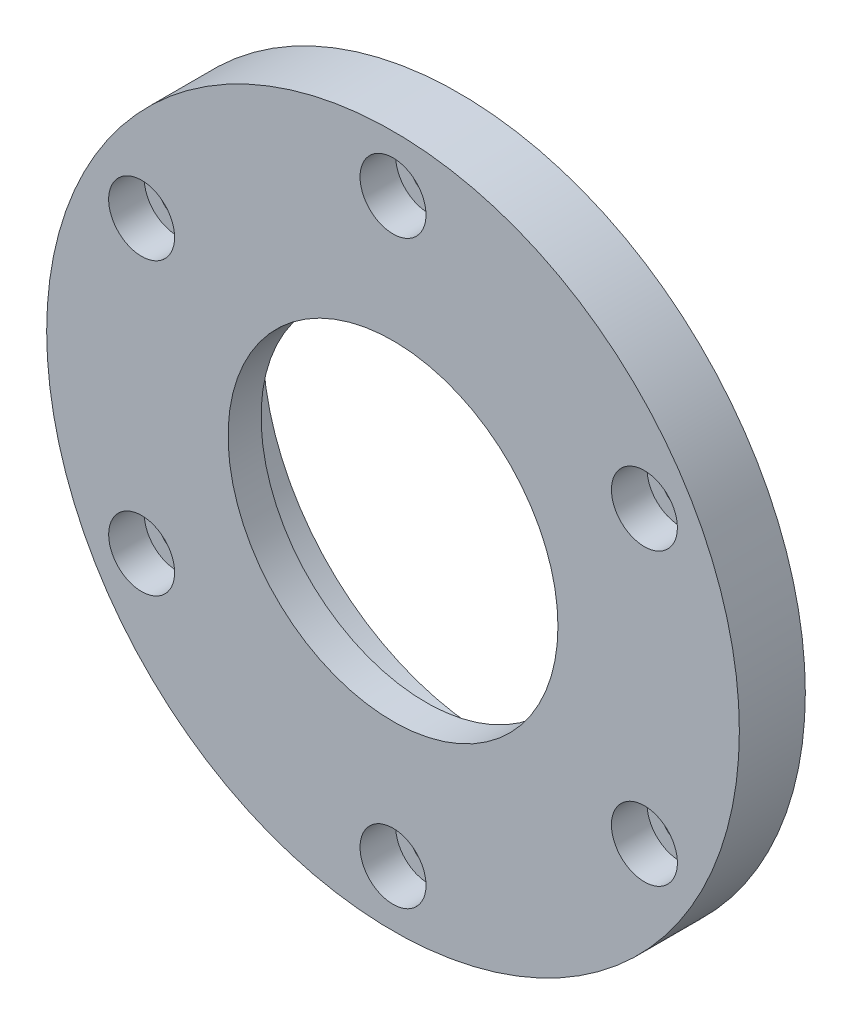
ISO-10303-21;
HEADER;
FILE_DESCRIPTION(('STEP AP214'),'2;1');
FILE_NAME('part.step','',(''),(''),'','','');
FILE_SCHEMA(('AUTOMOTIVE_DESIGN { 1 0 10303 214 1 1 1 1 }'));
ENDSEC;
DATA;
#1=APPLICATION_CONTEXT('core data for automotive mechanical design processes');
#2=APPLICATION_PROTOCOL_DEFINITION('international standard','automotive_design',2000,#1);
#3=PRODUCT_CONTEXT('',#1,'mechanical');
#4=PRODUCT('Part','Part','',(#3));
#5=PRODUCT_RELATED_PRODUCT_CATEGORY('part','',(#4));
#6=PRODUCT_DEFINITION_FORMATION('','',#4);
#7=PRODUCT_DEFINITION_CONTEXT('part definition',#1,'design');
#8=PRODUCT_DEFINITION('design','',#6,#7);
#9=PRODUCT_DEFINITION_SHAPE('','',#8);
#10=(LENGTH_UNIT() NAMED_UNIT(*) SI_UNIT(.MILLI.,.METRE.));
#11=(NAMED_UNIT(*) PLANE_ANGLE_UNIT() SI_UNIT($,.RADIAN.));
#12=(NAMED_UNIT(*) SI_UNIT($,.STERADIAN.) SOLID_ANGLE_UNIT());
#13=UNCERTAINTY_MEASURE_WITH_UNIT(LENGTH_MEASURE(1.E-05),#10,'distance_accuracy_value','');
#14=(GEOMETRIC_REPRESENTATION_CONTEXT(3) GLOBAL_UNCERTAINTY_ASSIGNED_CONTEXT((#13)) GLOBAL_UNIT_ASSIGNED_CONTEXT((#10,
#11,#12)) REPRESENTATION_CONTEXT('',''));
#15=CARTESIAN_POINT('',(0.,0.,0.));
#16=DIRECTION('',(0.,0.,1.));
#17=DIRECTION('',(1.,0.,0.));
#18=AXIS2_PLACEMENT_3D('',#15,#16,#17);
#19=CARTESIAN_POINT('',(0.,0.,10.));
#20=DIRECTION('',(0.,0.,1.));
#21=DIRECTION('',(1.,0.,0.));
#22=AXIS2_PLACEMENT_3D('',#19,#20,#21);
#23=PLANE('',#22);
#24=CARTESIAN_POINT('',(-38.105117766515,-22.0000000000004,10.));
#25=DIRECTION('',(0.,0.,1.));
#26=DIRECTION('',(0.50000000000001,-0.866025403784433,0.));
#27=AXIS2_PLACEMENT_3D('',#24,#25,#26);
#28=CIRCLE('',#27,5.);
#29=CARTESIAN_POINT('',(-35.605117766515,-26.3301270189226,10.));
#30=VERTEX_POINT('',#29);
#31=EDGE_CURVE('E158',#30,#30,#28,.T.);
#32=ORIENTED_EDGE('',*,*,#31,.F.);
#33=EDGE_LOOP('',(#32));
#34=FACE_BOUND('',#33,.T.);
#35=CARTESIAN_POINT('',(-38.1051177665155,21.9999999999996,10.));
#36=DIRECTION('',(0.,0.,1.));
#37=DIRECTION('',(-0.499999999999992,-0.866025403784443,0.));
#38=AXIS2_PLACEMENT_3D('',#35,#36,#37);
#39=CIRCLE('',#38,5.);
#40=CARTESIAN_POINT('',(-40.6051177665155,17.6698729810774,10.));
#41=VERTEX_POINT('',#40);
#42=EDGE_CURVE('E145',#41,#41,#39,.T.);
#43=ORIENTED_EDGE('',*,*,#42,.F.);
#44=EDGE_LOOP('',(#43));
#45=FACE_BOUND('',#44,.T.);
#46=CARTESIAN_POINT('',(0.,44.,10.));
#47=DIRECTION('',(0.,0.,1.));
#48=DIRECTION('',(-1.,0.,0.));
#49=AXIS2_PLACEMENT_3D('',#46,#47,#48);
#50=CIRCLE('',#49,5.);
#51=CARTESIAN_POINT('',(-5.,44.,10.));
#52=VERTEX_POINT('',#51);
#53=EDGE_CURVE('E133',#52,#52,#50,.T.);
#54=ORIENTED_EDGE('',*,*,#53,.F.);
#55=EDGE_LOOP('',(#54));
#56=FACE_BOUND('',#55,.T.);
#57=CARTESIAN_POINT('',(38.1051177665152,22.0000000000002,10.));
#58=DIRECTION('',(0.,0.,1.));
#59=DIRECTION('',(-0.500000000000004,0.866025403784436,0.));
#60=AXIS2_PLACEMENT_3D('',#57,#58,#59);
#61=CIRCLE('',#60,5.);
#62=CARTESIAN_POINT('',(35.6051177665152,26.3301270189224,10.));
#63=VERTEX_POINT('',#62);
#64=EDGE_CURVE('E121',#63,#63,#61,.T.);
#65=ORIENTED_EDGE('',*,*,#64,.F.);
#66=EDGE_LOOP('',(#65));
#67=FACE_BOUND('',#66,.T.);
#68=CARTESIAN_POINT('',(38.1051177665153,-21.9999999999999,10.));
#69=DIRECTION('',(0.,0.,1.));
#70=DIRECTION('',(0.499999999999998,0.86602540378444,0.));
#71=AXIS2_PLACEMENT_3D('',#68,#69,#70);
#72=CIRCLE('',#71,5.);
#73=CARTESIAN_POINT('',(40.6051177665153,-17.6698729810777,10.));
#74=VERTEX_POINT('',#73);
#75=EDGE_CURVE('E109',#74,#74,#72,.T.);
#76=ORIENTED_EDGE('',*,*,#75,.F.);
#77=EDGE_LOOP('',(#76));
#78=FACE_BOUND('',#77,.T.);
#79=CARTESIAN_POINT('',(0.,-44.,10.));
#80=DIRECTION('',(0.,0.,1.));
#81=DIRECTION('',(1.,0.,0.));
#82=AXIS2_PLACEMENT_3D('',#79,#80,#81);
#83=CIRCLE('',#82,5.);
#84=CARTESIAN_POINT('',(5.,-44.,10.));
#85=VERTEX_POINT('',#84);
#86=EDGE_CURVE('E97',#85,#85,#83,.T.);
#87=ORIENTED_EDGE('',*,*,#86,.F.);
#88=EDGE_LOOP('',(#87));
#89=FACE_BOUND('',#88,.T.);
#90=CARTESIAN_POINT('',(0.,0.,10.));
#91=DIRECTION('',(0.,0.,1.));
#92=DIRECTION('',(1.,0.,0.));
#93=AXIS2_PLACEMENT_3D('',#90,#91,#92);
#94=CIRCLE('',#93,52.5);
#95=CARTESIAN_POINT('',(52.5,0.,10.));
#96=VERTEX_POINT('',#95);
#97=EDGE_CURVE('E64',#96,#96,#94,.T.);
#98=ORIENTED_EDGE('',*,*,#97,.T.);
#99=EDGE_LOOP('',(#98));
#100=FACE_BOUND('',#99,.T.);
#101=CARTESIAN_POINT('',(0.,0.,10.));
#102=DIRECTION('',(0.,0.,1.));
#103=DIRECTION('',(1.,0.,0.));
#104=AXIS2_PLACEMENT_3D('',#101,#102,#103);
#105=CIRCLE('',#104,25.);
#106=CARTESIAN_POINT('',(25.,0.,10.));
#107=VERTEX_POINT('',#106);
#108=EDGE_CURVE('E68',#107,#107,#105,.T.);
#109=ORIENTED_EDGE('',*,*,#108,.F.);
#110=EDGE_LOOP('',(#109));
#111=FACE_BOUND('',#110,.T.);
#112=ADVANCED_FACE('F39',(#34,#45,#56,#67,#78,#89,#100,#111),#23,.T.);
#113=CARTESIAN_POINT('',(0.,0.,5.));
#114=DIRECTION('',(0.,0.,1.));
#115=DIRECTION('',(1.,0.,0.));
#116=AXIS2_PLACEMENT_3D('',#113,#114,#115);
#117=PLANE('',#116);
#118=CARTESIAN_POINT('',(0.,0.,5.));
#119=DIRECTION('',(0.,0.,1.));
#120=DIRECTION('',(1.,0.,0.));
#121=AXIS2_PLACEMENT_3D('',#118,#119,#120);
#122=CIRCLE('',#121,34.75);
#123=CARTESIAN_POINT('',(34.75,0.,5.));
#124=VERTEX_POINT('',#123);
#125=EDGE_CURVE('E83',#124,#124,#122,.T.);
#126=ORIENTED_EDGE('',*,*,#125,.F.);
#127=EDGE_LOOP('',(#126));
#128=FACE_BOUND('',#127,.T.);
#129=CARTESIAN_POINT('',(0.,0.,5.));
#130=DIRECTION('',(0.,0.,1.));
#131=DIRECTION('',(1.,0.,0.));
#132=AXIS2_PLACEMENT_3D('',#129,#130,#131);
#133=CIRCLE('',#132,25.);
#134=CARTESIAN_POINT('',(25.,0.,5.));
#135=VERTEX_POINT('',#134);
#136=EDGE_CURVE('E70',#135,#135,#133,.F.);
#137=ORIENTED_EDGE('',*,*,#136,.F.);
#138=EDGE_LOOP('',(#137));
#139=FACE_BOUND('',#138,.T.);
#140=ADVANCED_FACE('F196',(#128,#139),#117,.F.);
#141=CARTESIAN_POINT('',(0.,0.,-5.));
#142=DIRECTION('',(0.,0.,1.));
#143=DIRECTION('',(1.,0.,0.));
#144=AXIS2_PLACEMENT_3D('',#141,#142,#143);
#145=PLANE('',#144);
#146=CARTESIAN_POINT('',(0.,0.,-5.));
#147=DIRECTION('',(0.,0.,1.));
#148=DIRECTION('',(1.,0.,0.));
#149=AXIS2_PLACEMENT_3D('',#146,#147,#148);
#150=CIRCLE('',#149,38.);
#151=CARTESIAN_POINT('',(38.,0.,-5.));
#152=VERTEX_POINT('',#151);
#153=EDGE_CURVE('E77',#152,#152,#150,.T.);
#154=ORIENTED_EDGE('',*,*,#153,.F.);
#155=EDGE_LOOP('',(#154));
#156=FACE_BOUND('',#155,.T.);
#157=CARTESIAN_POINT('',(0.,0.,-5.));
#158=DIRECTION('',(0.,0.,1.));
#159=DIRECTION('',(1.,0.,0.));
#160=AXIS2_PLACEMENT_3D('',#157,#158,#159);
#161=CIRCLE('',#160,34.75);
#162=CARTESIAN_POINT('',(34.75,0.,-5.));
#163=VERTEX_POINT('',#162);
#164=EDGE_CURVE('E73',#163,#163,#161,.T.);
#165=ORIENTED_EDGE('',*,*,#164,.T.);
#166=EDGE_LOOP('',(#165));
#167=FACE_BOUND('',#166,.T.);
#168=ADVANCED_FACE('F188',(#156,#167),#145,.F.);
#169=CARTESIAN_POINT('',(0.,0.,10.));
#170=DIRECTION('',(0.,0.,-1.));
#171=DIRECTION('',(-1.,0.,0.));
#172=AXIS2_PLACEMENT_3D('',#169,#170,#171);
#173=CYLINDRICAL_SURFACE('',#172,52.5);
#174=ORIENTED_EDGE('',*,*,#97,.F.);
#175=EDGE_LOOP('',(#174));
#176=FACE_BOUND('',#175,.T.);
#177=CARTESIAN_POINT('',(0.,0.,0.));
#178=DIRECTION('',(0.,0.,1.));
#179=DIRECTION('',(1.,0.,0.));
#180=AXIS2_PLACEMENT_3D('',#177,#178,#179);
#181=CIRCLE('',#180,52.5);
#182=CARTESIAN_POINT('',(52.5,0.,0.));
#183=VERTEX_POINT('',#182);
#184=EDGE_CURVE('E74',#183,#183,#181,.T.);
#185=ORIENTED_EDGE('',*,*,#184,.T.);
#186=EDGE_LOOP('',(#185));
#187=FACE_BOUND('',#186,.T.);
#188=ADVANCED_FACE('F171',(#176,#187),#173,.T.);
#189=CARTESIAN_POINT('',(0.,0.,0.));
#190=DIRECTION('',(0.,0.,1.));
#191=DIRECTION('',(1.,0.,0.));
#192=AXIS2_PLACEMENT_3D('',#189,#190,#191);
#193=PLANE('',#192);
#194=CARTESIAN_POINT('',(0.,0.,0.));
#195=DIRECTION('',(0.,0.,-1.));
#196=DIRECTION('',(-1.,0.,0.));
#197=AXIS2_PLACEMENT_3D('',#194,#195,#196);
#198=CIRCLE('',#197,40.85);
#199=CARTESIAN_POINT('',(-40.85,0.,0.));
#200=VERTEX_POINT('',#199);
#201=EDGE_CURVE('E161',#200,#200,#198,.T.);
#202=ORIENTED_EDGE('',*,*,#201,.F.);
#203=EDGE_LOOP('',(#202));
#204=FACE_BOUND('',#203,.T.);
#205=CARTESIAN_POINT('',(-38.105117766515,-22.0000000000004,0.));
#206=DIRECTION('',(0.,0.,1.));
#207=DIRECTION('',(0.50000000000001,-0.866025403784433,0.));
#208=AXIS2_PLACEMENT_3D('',#205,#206,#207);
#209=CIRCLE('',#208,2.75);
#210=CARTESIAN_POINT('',(-36.730117766515,-24.3815698604076,0.));
#211=VERTEX_POINT('',#210);
#212=EDGE_CURVE('E155',#211,#211,#209,.T.);
#213=ORIENTED_EDGE('',*,*,#212,.T.);
#214=EDGE_LOOP('',(#213));
#215=FACE_BOUND('',#214,.T.);
#216=CARTESIAN_POINT('',(-38.1051177665155,21.9999999999996,0.));
#217=DIRECTION('',(0.,0.,1.));
#218=DIRECTION('',(-0.499999999999992,-0.866025403784443,0.));
#219=AXIS2_PLACEMENT_3D('',#216,#217,#218);
#220=CIRCLE('',#219,2.75);
#221=CARTESIAN_POINT('',(-39.4801177665155,19.6184301395924,0.));
#222=VERTEX_POINT('',#221);
#223=EDGE_CURVE('E142',#222,#222,#220,.T.);
#224=ORIENTED_EDGE('',*,*,#223,.T.);
#225=EDGE_LOOP('',(#224));
#226=FACE_BOUND('',#225,.T.);
#227=CARTESIAN_POINT('',(0.,44.,0.));
#228=DIRECTION('',(0.,0.,1.));
#229=DIRECTION('',(-1.,0.,0.));
#230=AXIS2_PLACEMENT_3D('',#227,#228,#229);
#231=CIRCLE('',#230,2.75);
#232=CARTESIAN_POINT('',(-2.75,44.,0.));
#233=VERTEX_POINT('',#232);
#234=EDGE_CURVE('E130',#233,#233,#231,.T.);
#235=ORIENTED_EDGE('',*,*,#234,.T.);
#236=EDGE_LOOP('',(#235));
#237=FACE_BOUND('',#236,.T.);
#238=CARTESIAN_POINT('',(38.1051177665152,22.0000000000002,0.));
#239=DIRECTION('',(0.,0.,1.));
#240=DIRECTION('',(-0.500000000000004,0.866025403784436,0.));
#241=AXIS2_PLACEMENT_3D('',#238,#239,#240);
#242=CIRCLE('',#241,2.75);
#243=CARTESIAN_POINT('',(36.7301177665152,24.3815698604074,0.));
#244=VERTEX_POINT('',#243);
#245=EDGE_CURVE('E118',#244,#244,#242,.T.);
#246=ORIENTED_EDGE('',*,*,#245,.T.);
#247=EDGE_LOOP('',(#246));
#248=FACE_BOUND('',#247,.T.);
#249=CARTESIAN_POINT('',(38.1051177665153,-21.9999999999999,0.));
#250=DIRECTION('',(0.,0.,1.));
#251=DIRECTION('',(0.499999999999998,0.86602540378444,0.));
#252=AXIS2_PLACEMENT_3D('',#249,#250,#251);
#253=CIRCLE('',#252,2.75);
#254=CARTESIAN_POINT('',(39.4801177665153,-19.6184301395927,0.));
#255=VERTEX_POINT('',#254);
#256=EDGE_CURVE('E106',#255,#255,#253,.T.);
#257=ORIENTED_EDGE('',*,*,#256,.T.);
#258=EDGE_LOOP('',(#257));
#259=FACE_BOUND('',#258,.T.);
#260=CARTESIAN_POINT('',(0.,-44.,0.));
#261=DIRECTION('',(0.,0.,1.));
#262=DIRECTION('',(1.,0.,0.));
#263=AXIS2_PLACEMENT_3D('',#260,#261,#262);
#264=CIRCLE('',#263,2.75);
#265=CARTESIAN_POINT('',(2.75,-44.,0.));
#266=VERTEX_POINT('',#265);
#267=EDGE_CURVE('E65',#266,#266,#264,.T.);
#268=ORIENTED_EDGE('',*,*,#267,.T.);
#269=EDGE_LOOP('',(#268));
#270=FACE_BOUND('',#269,.T.);
#271=ORIENTED_EDGE('',*,*,#184,.F.);
#272=EDGE_LOOP('',(#271));
#273=FACE_BOUND('',#272,.T.);
#274=ADVANCED_FACE('F167',(#204,#215,#226,#237,#248,#259,#270,#273),#193,.F.);
#275=CARTESIAN_POINT('',(0.,0.,-5.));
#276=DIRECTION('',(0.,0.,1.));
#277=DIRECTION('',(1.,0.,0.));
#278=AXIS2_PLACEMENT_3D('',#275,#276,#277);
#279=CYLINDRICAL_SURFACE('',#278,38.);
#280=CARTESIAN_POINT('',(0.,0.,1.15));
#281=DIRECTION('',(0.,0.,-1.));
#282=DIRECTION('',(-1.,0.,0.));
#283=AXIS2_PLACEMENT_3D('',#280,#281,#282);
#284=CIRCLE('',#283,38.);
#285=CARTESIAN_POINT('',(-38.,0.,1.15));
#286=VERTEX_POINT('',#285);
#287=EDGE_CURVE('E59',#286,#286,#284,.T.);
#288=ORIENTED_EDGE('',*,*,#287,.T.);
#289=EDGE_LOOP('',(#288));
#290=FACE_BOUND('',#289,.T.);
#291=ORIENTED_EDGE('',*,*,#153,.T.);
#292=EDGE_LOOP('',(#291));
#293=FACE_BOUND('',#292,.T.);
#294=ADVANCED_FACE('F170',(#290,#293),#279,.T.);
#295=CARTESIAN_POINT('',(0.,0.,5.));
#296=DIRECTION('',(0.,0.,-1.));
#297=DIRECTION('',(-1.,0.,0.));
#298=AXIS2_PLACEMENT_3D('',#295,#296,#297);
#299=CYLINDRICAL_SURFACE('',#298,34.75);
#300=ORIENTED_EDGE('',*,*,#125,.T.);
#301=EDGE_LOOP('',(#300));
#302=FACE_BOUND('',#301,.T.);
#303=ORIENTED_EDGE('',*,*,#164,.F.);
#304=EDGE_LOOP('',(#303));
#305=FACE_BOUND('',#304,.T.);
#306=ADVANCED_FACE('F213',(#302,#305),#299,.F.);
#307=CARTESIAN_POINT('',(0.,0.,10.));
#308=DIRECTION('',(0.,0.,-1.));
#309=DIRECTION('',(-1.,0.,0.));
#310=AXIS2_PLACEMENT_3D('',#307,#308,#309);
#311=CYLINDRICAL_SURFACE('',#310,25.);
#312=ORIENTED_EDGE('',*,*,#108,.T.);
#313=EDGE_LOOP('',(#312));
#314=FACE_BOUND('',#313,.T.);
#315=ORIENTED_EDGE('',*,*,#136,.T.);
#316=EDGE_LOOP('',(#315));
#317=FACE_BOUND('',#316,.T.);
#318=ADVANCED_FACE('F216',(#314,#317),#311,.F.);
#319=CARTESIAN_POINT('',(0.,-44.,10.));
#320=DIRECTION('',(0.,0.,1.));
#321=DIRECTION('',(1.,0.,0.));
#322=AXIS2_PLACEMENT_3D('',#319,#320,#321);
#323=CYLINDRICAL_SURFACE('',#322,2.75);
#324=CARTESIAN_POINT('',(0.,-44.,4.6));
#325=DIRECTION('',(0.,0.,1.));
#326=DIRECTION('',(1.,0.,0.));
#327=AXIS2_PLACEMENT_3D('',#324,#325,#326);
#328=CIRCLE('',#327,2.75);
#329=CARTESIAN_POINT('',(2.75,-44.,4.6));
#330=VERTEX_POINT('',#329);
#331=EDGE_CURVE('E69',#330,#330,#328,.T.);
#332=ORIENTED_EDGE('',*,*,#331,.T.);
#333=EDGE_LOOP('',(#332));
#334=FACE_BOUND('',#333,.T.);
#335=ORIENTED_EDGE('',*,*,#267,.F.);
#336=EDGE_LOOP('',(#335));
#337=FACE_BOUND('',#336,.T.);
#338=ADVANCED_FACE('F221',(#334,#337),#323,.F.);
#339=CARTESIAN_POINT('',(2.75,-44.,4.6));
#340=DIRECTION('',(0.,0.,-1.));
#341=DIRECTION('',(-1.,0.,0.));
#342=AXIS2_PLACEMENT_3D('',#339,#340,#341);
#343=PLANE('',#342);
#344=ORIENTED_EDGE('',*,*,#331,.F.);
#345=EDGE_LOOP('',(#344));
#346=FACE_BOUND('',#345,.T.);
#347=CARTESIAN_POINT('',(0.,-44.,4.6));
#348=DIRECTION('',(0.,0.,1.));
#349=DIRECTION('',(1.,0.,0.));
#350=AXIS2_PLACEMENT_3D('',#347,#348,#349);
#351=CIRCLE('',#350,5.);
#352=CARTESIAN_POINT('',(5.,-44.,4.6));
#353=VERTEX_POINT('',#352);
#354=EDGE_CURVE('E94',#353,#353,#351,.T.);
#355=ORIENTED_EDGE('',*,*,#354,.T.);
#356=EDGE_LOOP('',(#355));
#357=FACE_BOUND('',#356,.T.);
#358=ADVANCED_FACE('F225',(#346,#357),#343,.F.);
#359=CARTESIAN_POINT('',(0.,-44.,10.));
#360=DIRECTION('',(0.,0.,1.));
#361=DIRECTION('',(1.,0.,0.));
#362=AXIS2_PLACEMENT_3D('',#359,#360,#361);
#363=CYLINDRICAL_SURFACE('',#362,5.);
#364=ORIENTED_EDGE('',*,*,#354,.F.);
#365=EDGE_LOOP('',(#364));
#366=FACE_BOUND('',#365,.T.);
#367=ORIENTED_EDGE('',*,*,#86,.T.);
#368=EDGE_LOOP('',(#367));
#369=FACE_BOUND('',#368,.T.);
#370=ADVANCED_FACE('F229',(#366,#369),#363,.F.);
#371=CARTESIAN_POINT('',(38.1051177665153,-21.9999999999999,10.));
#372=DIRECTION('',(0.,0.,1.));
#373=DIRECTION('',(0.499999999999998,0.86602540378444,0.));
#374=AXIS2_PLACEMENT_3D('',#371,#372,#373);
#375=CYLINDRICAL_SURFACE('',#374,2.75);
#376=CARTESIAN_POINT('',(38.1051177665153,-21.9999999999999,4.6));
#377=DIRECTION('',(0.,0.,1.));
#378=DIRECTION('',(0.499999999999998,0.86602540378444,0.));
#379=AXIS2_PLACEMENT_3D('',#376,#377,#378);
#380=CIRCLE('',#379,2.75);
#381=CARTESIAN_POINT('',(39.4801177665153,-19.6184301395927,4.6));
#382=VERTEX_POINT('',#381);
#383=EDGE_CURVE('E100',#382,#382,#380,.T.);
#384=ORIENTED_EDGE('',*,*,#383,.T.);
#385=EDGE_LOOP('',(#384));
#386=FACE_BOUND('',#385,.T.);
#387=ORIENTED_EDGE('',*,*,#256,.F.);
#388=EDGE_LOOP('',(#387));
#389=FACE_BOUND('',#388,.T.);
#390=ADVANCED_FACE('F233',(#386,#389),#375,.F.);
#391=CARTESIAN_POINT('',(39.4801177665153,-19.6184301395927,4.6));
#392=DIRECTION('',(0.,0.,-1.));
#393=DIRECTION('',(-0.499999999999998,-0.86602540378444,0.));
#394=AXIS2_PLACEMENT_3D('',#391,#392,#393);
#395=PLANE('',#394);
#396=ORIENTED_EDGE('',*,*,#383,.F.);
#397=EDGE_LOOP('',(#396));
#398=FACE_BOUND('',#397,.T.);
#399=CARTESIAN_POINT('',(38.1051177665153,-21.9999999999999,4.6));
#400=DIRECTION('',(0.,0.,1.));
#401=DIRECTION('',(0.499999999999998,0.86602540378444,0.));
#402=AXIS2_PLACEMENT_3D('',#399,#400,#401);
#403=CIRCLE('',#402,5.);
#404=CARTESIAN_POINT('',(40.6051177665153,-17.6698729810777,4.6));
#405=VERTEX_POINT('',#404);
#406=EDGE_CURVE('E103',#405,#405,#403,.T.);
#407=ORIENTED_EDGE('',*,*,#406,.T.);
#408=EDGE_LOOP('',(#407));
#409=FACE_BOUND('',#408,.T.);
#410=ADVANCED_FACE('F237',(#398,#409),#395,.F.);
#411=CARTESIAN_POINT('',(38.1051177665153,-21.9999999999999,10.));
#412=DIRECTION('',(0.,0.,1.));
#413=DIRECTION('',(0.499999999999998,0.86602540378444,0.));
#414=AXIS2_PLACEMENT_3D('',#411,#412,#413);
#415=CYLINDRICAL_SURFACE('',#414,5.);
#416=ORIENTED_EDGE('',*,*,#406,.F.);
#417=EDGE_LOOP('',(#416));
#418=FACE_BOUND('',#417,.T.);
#419=ORIENTED_EDGE('',*,*,#75,.T.);
#420=EDGE_LOOP('',(#419));
#421=FACE_BOUND('',#420,.T.);
#422=ADVANCED_FACE('F241',(#418,#421),#415,.F.);
#423=CARTESIAN_POINT('',(38.1051177665152,22.0000000000002,10.));
#424=DIRECTION('',(0.,0.,1.));
#425=DIRECTION('',(-0.500000000000004,0.866025403784436,0.));
#426=AXIS2_PLACEMENT_3D('',#423,#424,#425);
#427=CYLINDRICAL_SURFACE('',#426,2.75);
#428=CARTESIAN_POINT('',(38.1051177665152,22.0000000000002,4.6));
#429=DIRECTION('',(0.,0.,1.));
#430=DIRECTION('',(-0.500000000000004,0.866025403784436,0.));
#431=AXIS2_PLACEMENT_3D('',#428,#429,#430);
#432=CIRCLE('',#431,2.75);
#433=CARTESIAN_POINT('',(36.7301177665152,24.3815698604074,4.6));
#434=VERTEX_POINT('',#433);
#435=EDGE_CURVE('E112',#434,#434,#432,.T.);
#436=ORIENTED_EDGE('',*,*,#435,.T.);
#437=EDGE_LOOP('',(#436));
#438=FACE_BOUND('',#437,.T.);
#439=ORIENTED_EDGE('',*,*,#245,.F.);
#440=EDGE_LOOP('',(#439));
#441=FACE_BOUND('',#440,.T.);
#442=ADVANCED_FACE('F245',(#438,#441),#427,.F.);
#443=CARTESIAN_POINT('',(36.7301177665152,24.3815698604074,4.6));
#444=DIRECTION('',(0.,0.,-1.));
#445=DIRECTION('',(0.500000000000004,-0.866025403784436,0.));
#446=AXIS2_PLACEMENT_3D('',#443,#444,#445);
#447=PLANE('',#446);
#448=ORIENTED_EDGE('',*,*,#435,.F.);
#449=EDGE_LOOP('',(#448));
#450=FACE_BOUND('',#449,.T.);
#451=CARTESIAN_POINT('',(38.1051177665152,22.0000000000002,4.6));
#452=DIRECTION('',(0.,0.,1.));
#453=DIRECTION('',(-0.500000000000004,0.866025403784436,0.));
#454=AXIS2_PLACEMENT_3D('',#451,#452,#453);
#455=CIRCLE('',#454,5.);
#456=CARTESIAN_POINT('',(35.6051177665152,26.3301270189224,4.6));
#457=VERTEX_POINT('',#456);
#458=EDGE_CURVE('E115',#457,#457,#455,.T.);
#459=ORIENTED_EDGE('',*,*,#458,.T.);
#460=EDGE_LOOP('',(#459));
#461=FACE_BOUND('',#460,.T.);
#462=ADVANCED_FACE('F249',(#450,#461),#447,.F.);
#463=CARTESIAN_POINT('',(38.1051177665152,22.0000000000002,10.));
#464=DIRECTION('',(0.,0.,1.));
#465=DIRECTION('',(-0.500000000000004,0.866025403784436,0.));
#466=AXIS2_PLACEMENT_3D('',#463,#464,#465);
#467=CYLINDRICAL_SURFACE('',#466,5.);
#468=ORIENTED_EDGE('',*,*,#458,.F.);
#469=EDGE_LOOP('',(#468));
#470=FACE_BOUND('',#469,.T.);
#471=ORIENTED_EDGE('',*,*,#64,.T.);
#472=EDGE_LOOP('',(#471));
#473=FACE_BOUND('',#472,.T.);
#474=ADVANCED_FACE('F253',(#470,#473),#467,.F.);
#475=CARTESIAN_POINT('',(0.,44.,10.));
#476=DIRECTION('',(0.,0.,1.));
#477=DIRECTION('',(-1.,0.,0.));
#478=AXIS2_PLACEMENT_3D('',#475,#476,#477);
#479=CYLINDRICAL_SURFACE('',#478,2.75);
#480=CARTESIAN_POINT('',(0.,44.,4.6));
#481=DIRECTION('',(0.,0.,1.));
#482=DIRECTION('',(-1.,0.,0.));
#483=AXIS2_PLACEMENT_3D('',#480,#481,#482);
#484=CIRCLE('',#483,2.75);
#485=CARTESIAN_POINT('',(-2.75,44.,4.6));
#486=VERTEX_POINT('',#485);
#487=EDGE_CURVE('E124',#486,#486,#484,.T.);
#488=ORIENTED_EDGE('',*,*,#487,.T.);
#489=EDGE_LOOP('',(#488));
#490=FACE_BOUND('',#489,.T.);
#491=ORIENTED_EDGE('',*,*,#234,.F.);
#492=EDGE_LOOP('',(#491));
#493=FACE_BOUND('',#492,.T.);
#494=ADVANCED_FACE('F257',(#490,#493),#479,.F.);
#495=CARTESIAN_POINT('',(-2.75,44.,4.6));
#496=DIRECTION('',(0.,0.,-1.));
#497=DIRECTION('',(1.,0.,0.));
#498=AXIS2_PLACEMENT_3D('',#495,#496,#497);
#499=PLANE('',#498);
#500=ORIENTED_EDGE('',*,*,#487,.F.);
#501=EDGE_LOOP('',(#500));
#502=FACE_BOUND('',#501,.T.);
#503=CARTESIAN_POINT('',(0.,44.,4.6));
#504=DIRECTION('',(0.,0.,1.));
#505=DIRECTION('',(-1.,0.,0.));
#506=AXIS2_PLACEMENT_3D('',#503,#504,#505);
#507=CIRCLE('',#506,5.);
#508=CARTESIAN_POINT('',(-5.,44.,4.6));
#509=VERTEX_POINT('',#508);
#510=EDGE_CURVE('E127',#509,#509,#507,.T.);
#511=ORIENTED_EDGE('',*,*,#510,.T.);
#512=EDGE_LOOP('',(#511));
#513=FACE_BOUND('',#512,.T.);
#514=ADVANCED_FACE('F261',(#502,#513),#499,.F.);
#515=CARTESIAN_POINT('',(0.,44.,10.));
#516=DIRECTION('',(0.,0.,1.));
#517=DIRECTION('',(-1.,0.,0.));
#518=AXIS2_PLACEMENT_3D('',#515,#516,#517);
#519=CYLINDRICAL_SURFACE('',#518,5.);
#520=ORIENTED_EDGE('',*,*,#510,.F.);
#521=EDGE_LOOP('',(#520));
#522=FACE_BOUND('',#521,.T.);
#523=ORIENTED_EDGE('',*,*,#53,.T.);
#524=EDGE_LOOP('',(#523));
#525=FACE_BOUND('',#524,.T.);
#526=ADVANCED_FACE('F265',(#522,#525),#519,.F.);
#527=CARTESIAN_POINT('',(-38.1051177665155,21.9999999999996,10.));
#528=DIRECTION('',(0.,0.,1.));
#529=DIRECTION('',(-0.499999999999992,-0.866025403784443,0.));
#530=AXIS2_PLACEMENT_3D('',#527,#528,#529);
#531=CYLINDRICAL_SURFACE('',#530,2.75);
#532=CARTESIAN_POINT('',(-38.1051177665155,21.9999999999996,4.6));
#533=DIRECTION('',(0.,0.,1.));
#534=DIRECTION('',(-0.499999999999992,-0.866025403784443,0.));
#535=AXIS2_PLACEMENT_3D('',#532,#533,#534);
#536=CIRCLE('',#535,2.75);
#537=CARTESIAN_POINT('',(-39.4801177665155,19.6184301395924,4.6));
#538=VERTEX_POINT('',#537);
#539=EDGE_CURVE('E136',#538,#538,#536,.T.);
#540=ORIENTED_EDGE('',*,*,#539,.T.);
#541=EDGE_LOOP('',(#540));
#542=FACE_BOUND('',#541,.T.);
#543=ORIENTED_EDGE('',*,*,#223,.F.);
#544=EDGE_LOOP('',(#543));
#545=FACE_BOUND('',#544,.T.);
#546=ADVANCED_FACE('F269',(#542,#545),#531,.F.);
#547=CARTESIAN_POINT('',(-39.4801177665155,19.6184301395924,4.6));
#548=DIRECTION('',(0.,0.,-1.));
#549=DIRECTION('',(0.499999999999992,0.866025403784443,0.));
#550=AXIS2_PLACEMENT_3D('',#547,#548,#549);
#551=PLANE('',#550);
#552=ORIENTED_EDGE('',*,*,#539,.F.);
#553=EDGE_LOOP('',(#552));
#554=FACE_BOUND('',#553,.T.);
#555=CARTESIAN_POINT('',(-38.1051177665155,21.9999999999996,4.6));
#556=DIRECTION('',(0.,0.,1.));
#557=DIRECTION('',(-0.499999999999992,-0.866025403784443,0.));
#558=AXIS2_PLACEMENT_3D('',#555,#556,#557);
#559=CIRCLE('',#558,5.);
#560=CARTESIAN_POINT('',(-40.6051177665155,17.6698729810774,4.6));
#561=VERTEX_POINT('',#560);
#562=EDGE_CURVE('E139',#561,#561,#559,.T.);
#563=ORIENTED_EDGE('',*,*,#562,.T.);
#564=EDGE_LOOP('',(#563));
#565=FACE_BOUND('',#564,.T.);
#566=ADVANCED_FACE('F273',(#554,#565),#551,.F.);
#567=CARTESIAN_POINT('',(-38.1051177665155,21.9999999999996,10.));
#568=DIRECTION('',(0.,0.,1.));
#569=DIRECTION('',(-0.499999999999992,-0.866025403784443,0.));
#570=AXIS2_PLACEMENT_3D('',#567,#568,#569);
#571=CYLINDRICAL_SURFACE('',#570,5.);
#572=ORIENTED_EDGE('',*,*,#562,.F.);
#573=EDGE_LOOP('',(#572));
#574=FACE_BOUND('',#573,.T.);
#575=ORIENTED_EDGE('',*,*,#42,.T.);
#576=EDGE_LOOP('',(#575));
#577=FACE_BOUND('',#576,.T.);
#578=ADVANCED_FACE('F277',(#574,#577),#571,.F.);
#579=CARTESIAN_POINT('',(-38.105117766515,-22.0000000000004,10.));
#580=DIRECTION('',(0.,0.,1.));
#581=DIRECTION('',(0.50000000000001,-0.866025403784433,0.));
#582=AXIS2_PLACEMENT_3D('',#579,#580,#581);
#583=CYLINDRICAL_SURFACE('',#582,2.75);
#584=CARTESIAN_POINT('',(-38.105117766515,-22.0000000000004,4.6));
#585=DIRECTION('',(0.,0.,1.));
#586=DIRECTION('',(0.50000000000001,-0.866025403784433,0.));
#587=AXIS2_PLACEMENT_3D('',#584,#585,#586);
#588=CIRCLE('',#587,2.75);
#589=CARTESIAN_POINT('',(-36.730117766515,-24.3815698604076,4.6));
#590=VERTEX_POINT('',#589);
#591=EDGE_CURVE('E149',#590,#590,#588,.T.);
#592=ORIENTED_EDGE('',*,*,#591,.T.);
#593=EDGE_LOOP('',(#592));
#594=FACE_BOUND('',#593,.T.);
#595=ORIENTED_EDGE('',*,*,#212,.F.);
#596=EDGE_LOOP('',(#595));
#597=FACE_BOUND('',#596,.T.);
#598=ADVANCED_FACE('F281',(#594,#597),#583,.F.);
#599=CARTESIAN_POINT('',(-36.730117766515,-24.3815698604076,4.6));
#600=DIRECTION('',(0.,0.,-1.));
#601=DIRECTION('',(-0.50000000000001,0.866025403784433,0.));
#602=AXIS2_PLACEMENT_3D('',#599,#600,#601);
#603=PLANE('',#602);
#604=ORIENTED_EDGE('',*,*,#591,.F.);
#605=EDGE_LOOP('',(#604));
#606=FACE_BOUND('',#605,.T.);
#607=CARTESIAN_POINT('',(-38.105117766515,-22.0000000000004,4.6));
#608=DIRECTION('',(0.,0.,1.));
#609=DIRECTION('',(0.50000000000001,-0.866025403784433,0.));
#610=AXIS2_PLACEMENT_3D('',#607,#608,#609);
#611=CIRCLE('',#610,5.);
#612=CARTESIAN_POINT('',(-35.605117766515,-26.3301270189226,4.6));
#613=VERTEX_POINT('',#612);
#614=EDGE_CURVE('E152',#613,#613,#611,.T.);
#615=ORIENTED_EDGE('',*,*,#614,.T.);
#616=EDGE_LOOP('',(#615));
#617=FACE_BOUND('',#616,.T.);
#618=ADVANCED_FACE('F285',(#606,#617),#603,.F.);
#619=CARTESIAN_POINT('',(-38.105117766515,-22.0000000000004,10.));
#620=DIRECTION('',(0.,0.,1.));
#621=DIRECTION('',(0.50000000000001,-0.866025403784433,0.));
#622=AXIS2_PLACEMENT_3D('',#619,#620,#621);
#623=CYLINDRICAL_SURFACE('',#622,5.);
#624=ORIENTED_EDGE('',*,*,#614,.F.);
#625=EDGE_LOOP('',(#624));
#626=FACE_BOUND('',#625,.T.);
#627=ORIENTED_EDGE('',*,*,#31,.T.);
#628=EDGE_LOOP('',(#627));
#629=FACE_BOUND('',#628,.T.);
#630=ADVANCED_FACE('F289',(#626,#629),#623,.F.);
#631=CARTESIAN_POINT('',(0.,0.,1.45));
#632=DIRECTION('',(0.,0.,-1.));
#633=DIRECTION('',(-1.,0.,0.));
#634=AXIS2_PLACEMENT_3D('',#631,#632,#633);
#635=CYLINDRICAL_SURFACE('',#634,40.85);
#636=CARTESIAN_POINT('',(0.,0.,1.15));
#637=DIRECTION('',(0.,0.,-1.));
#638=DIRECTION('',(-1.,0.,0.));
#639=AXIS2_PLACEMENT_3D('',#636,#637,#638);
#640=CIRCLE('',#639,40.85);
#641=CARTESIAN_POINT('',(-40.85,0.,1.15));
#642=VERTEX_POINT('',#641);
#643=EDGE_CURVE('E11',#642,#642,#640,.F.);
#644=ORIENTED_EDGE('',*,*,#643,.T.);
#645=EDGE_LOOP('',(#644));
#646=FACE_BOUND('',#645,.T.);
#647=ORIENTED_EDGE('',*,*,#201,.T.);
#648=EDGE_LOOP('',(#647));
#649=FACE_BOUND('',#648,.T.);
#650=ADVANCED_FACE('F165',(#646,#649),#635,.F.);
#651=CARTESIAN_POINT('',(0.,0.,1.45));
#652=DIRECTION('',(0.,0.,-1.));
#653=DIRECTION('',(-1.,0.,0.));
#654=AXIS2_PLACEMENT_3D('',#651,#652,#653);
#655=PLANE('',#654);
#656=CARTESIAN_POINT('',(0.,0.,1.45));
#657=DIRECTION('',(0.,0.,-1.));
#658=DIRECTION('',(-1.,0.,0.));
#659=AXIS2_PLACEMENT_3D('',#656,#657,#658);
#660=CIRCLE('',#659,38.3);
#661=CARTESIAN_POINT('',(-38.3,0.,1.45));
#662=VERTEX_POINT('',#661);
#663=EDGE_CURVE('E47',#662,#662,#660,.F.);
#664=ORIENTED_EDGE('',*,*,#663,.T.);
#665=EDGE_LOOP('',(#664));
#666=FACE_BOUND('',#665,.T.);
#667=CARTESIAN_POINT('',(0.,0.,1.45));
#668=DIRECTION('',(0.,0.,-1.));
#669=DIRECTION('',(-1.,0.,0.));
#670=AXIS2_PLACEMENT_3D('',#667,#668,#669);
#671=CIRCLE('',#670,40.55);
#672=CARTESIAN_POINT('',(-40.55,0.,1.45));
#673=VERTEX_POINT('',#672);
#674=EDGE_CURVE('E54',#673,#673,#671,.T.);
#675=ORIENTED_EDGE('',*,*,#674,.T.);
#676=EDGE_LOOP('',(#675));
#677=FACE_BOUND('',#676,.T.);
#678=ADVANCED_FACE('F296',(#666,#677),#655,.T.);
#679=CARTESIAN_POINT('',(0.,0.,1.15));
#680=DIRECTION('',(0.,0.,-1.));
#681=DIRECTION('',(-1.,0.,0.));
#682=AXIS2_PLACEMENT_3D('',#679,#680,#681);
#683=TOROIDAL_SURFACE('',#682,38.3,0.3);
#684=ORIENTED_EDGE('',*,*,#663,.F.);
#685=EDGE_LOOP('',(#684));
#686=FACE_BOUND('',#685,.T.);
#687=ORIENTED_EDGE('',*,*,#287,.F.);
#688=EDGE_LOOP('',(#687));
#689=FACE_BOUND('',#688,.T.);
#690=ADVANCED_FACE('F298',(#686,#689),#683,.F.);
#691=CARTESIAN_POINT('',(0.,0.,1.15));
#692=DIRECTION('',(0.,0.,-1.));
#693=DIRECTION('',(-1.,0.,0.));
#694=AXIS2_PLACEMENT_3D('',#691,#692,#693);
#695=TOROIDAL_SURFACE('',#694,40.55,0.3);
#696=ORIENTED_EDGE('',*,*,#643,.F.);
#697=EDGE_LOOP('',(#696));
#698=FACE_BOUND('',#697,.T.);
#699=ORIENTED_EDGE('',*,*,#674,.F.);
#700=EDGE_LOOP('',(#699));
#701=FACE_BOUND('',#700,.T.);
#702=ADVANCED_FACE('F41',(#698,#701),#695,.F.);
#703=CLOSED_SHELL('',(#112,#140,#168,#188,#274,#294,#306,#318,#338,#358,#370,#390,#410,#422,
#442,#462,#474,#494,#514,#526,#546,#566,#578,#598,#618,#630,#650,#678,#690,#702));
#704=MANIFOLD_SOLID_BREP('B2',#703);
#705=ADVANCED_BREP_SHAPE_REPRESENTATION('',(#18,#704),#14);
#706=SHAPE_DEFINITION_REPRESENTATION(#9,#705);
ENDSEC;
END-ISO-10303-21;
